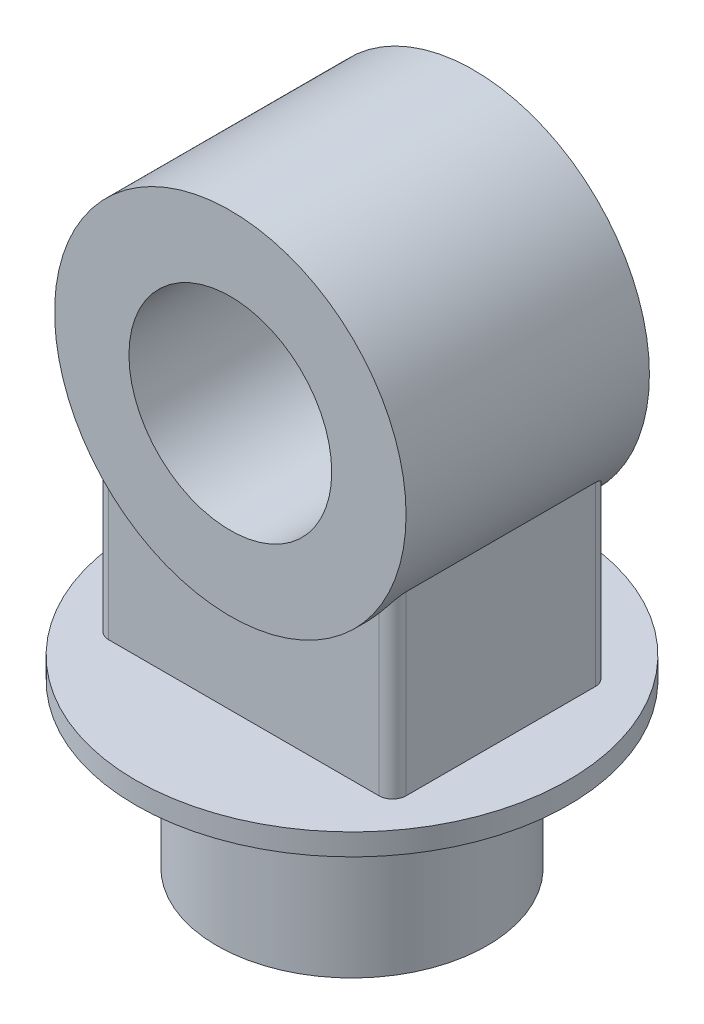
ISO-10303-21;
HEADER;
FILE_DESCRIPTION(('STEP AP214'),'2;1');
FILE_NAME('part.step','',(''),(''),'','','');
FILE_SCHEMA(('AUTOMOTIVE_DESIGN { 1 0 10303 214 1 1 1 1 }'));
ENDSEC;
DATA;
#1=APPLICATION_CONTEXT('core data for automotive mechanical design processes');
#2=APPLICATION_PROTOCOL_DEFINITION('international standard','automotive_design',2000,#1);
#3=PRODUCT_CONTEXT('',#1,'mechanical');
#4=PRODUCT('Part','Part','',(#3));
#5=PRODUCT_RELATED_PRODUCT_CATEGORY('part','',(#4));
#6=PRODUCT_DEFINITION_FORMATION('','',#4);
#7=PRODUCT_DEFINITION_CONTEXT('part definition',#1,'design');
#8=PRODUCT_DEFINITION('design','',#6,#7);
#9=PRODUCT_DEFINITION_SHAPE('','',#8);
#10=(LENGTH_UNIT() NAMED_UNIT(*) SI_UNIT(.MILLI.,.METRE.));
#11=(NAMED_UNIT(*) PLANE_ANGLE_UNIT() SI_UNIT($,.RADIAN.));
#12=(NAMED_UNIT(*) SI_UNIT($,.STERADIAN.) SOLID_ANGLE_UNIT());
#13=UNCERTAINTY_MEASURE_WITH_UNIT(LENGTH_MEASURE(1.E-05),#10,'distance_accuracy_value','');
#14=(GEOMETRIC_REPRESENTATION_CONTEXT(3) GLOBAL_UNCERTAINTY_ASSIGNED_CONTEXT((#13)) GLOBAL_UNIT_ASSIGNED_CONTEXT((#10,
#11,#12)) REPRESENTATION_CONTEXT('',''));
#15=CARTESIAN_POINT('',(0.,0.,0.));
#16=DIRECTION('',(0.,0.,1.));
#17=DIRECTION('',(1.,0.,0.));
#18=AXIS2_PLACEMENT_3D('',#15,#16,#17);
#19=CARTESIAN_POINT('',(0.,120.,0.));
#20=DIRECTION('',(0.,-1.,0.));
#21=DIRECTION('',(0.,0.,-1.));
#22=AXIS2_PLACEMENT_3D('',#19,#20,#21);
#23=CYLINDRICAL_SURFACE('',#22,100.);
#24=CARTESIAN_POINT('',(0.,120.,0.));
#25=DIRECTION('',(0.,1.,0.));
#26=DIRECTION('',(0.,0.,1.));
#27=AXIS2_PLACEMENT_3D('',#24,#25,#26);
#28=CIRCLE('',#27,100.);
#29=CARTESIAN_POINT('',(0.,120.,100.));
#30=VERTEX_POINT('',#29);
#31=EDGE_CURVE('E137',#30,#30,#28,.T.);
#32=ORIENTED_EDGE('',*,*,#31,.F.);
#33=EDGE_LOOP('',(#32));
#34=FACE_BOUND('',#33,.T.);
#35=CARTESIAN_POINT('',(0.,0.,0.));
#36=DIRECTION('',(0.,1.,0.));
#37=DIRECTION('',(0.,0.,1.));
#38=AXIS2_PLACEMENT_3D('',#35,#36,#37);
#39=CIRCLE('',#38,100.);
#40=CARTESIAN_POINT('',(0.,0.,100.));
#41=VERTEX_POINT('',#40);
#42=EDGE_CURVE('E211',#41,#41,#39,.T.);
#43=ORIENTED_EDGE('',*,*,#42,.T.);
#44=EDGE_LOOP('',(#43));
#45=FACE_BOUND('',#44,.T.);
#46=ADVANCED_FACE('F37',(#34,#45),#23,.T.);
#47=CARTESIAN_POINT('',(0.,0.,0.));
#48=DIRECTION('',(0.,1.,0.));
#49=DIRECTION('',(0.,0.,1.));
#50=AXIS2_PLACEMENT_3D('',#47,#48,#49);
#51=PLANE('',#50);
#52=ORIENTED_EDGE('',*,*,#42,.F.);
#53=EDGE_LOOP('',(#52));
#54=FACE_BOUND('',#53,.T.);
#55=ADVANCED_FACE('F220',(#54),#51,.F.);
#56=CARTESIAN_POINT('',(0.,136.,0.));
#57=DIRECTION('',(0.,-1.,0.));
#58=DIRECTION('',(0.,0.,-1.));
#59=AXIS2_PLACEMENT_3D('',#56,#57,#58);
#60=CYLINDRICAL_SURFACE('',#59,160.);
#61=CARTESIAN_POINT('',(0.,136.,0.));
#62=DIRECTION('',(0.,1.,0.));
#63=DIRECTION('',(0.,0.,1.));
#64=AXIS2_PLACEMENT_3D('',#61,#62,#63);
#65=CIRCLE('',#64,160.);
#66=CARTESIAN_POINT('',(0.,136.,160.));
#67=VERTEX_POINT('',#66);
#68=EDGE_CURVE('E208',#67,#67,#65,.T.);
#69=ORIENTED_EDGE('',*,*,#68,.F.);
#70=EDGE_LOOP('',(#69));
#71=FACE_BOUND('',#70,.T.);
#72=CARTESIAN_POINT('',(0.,120.,0.));
#73=DIRECTION('',(0.,1.,0.));
#74=DIRECTION('',(0.,0.,1.));
#75=AXIS2_PLACEMENT_3D('',#72,#73,#74);
#76=CIRCLE('',#75,160.);
#77=CARTESIAN_POINT('',(0.,120.,160.));
#78=VERTEX_POINT('',#77);
#79=EDGE_CURVE('E212',#78,#78,#76,.T.);
#80=ORIENTED_EDGE('',*,*,#79,.T.);
#81=EDGE_LOOP('',(#80));
#82=FACE_BOUND('',#81,.T.);
#83=ADVANCED_FACE('F222',(#71,#82),#60,.T.);
#84=CARTESIAN_POINT('',(0.,136.,0.));
#85=DIRECTION('',(0.,1.,0.));
#86=DIRECTION('',(0.,0.,1.));
#87=AXIS2_PLACEMENT_3D('',#84,#85,#86);
#88=PLANE('',#87);
#89=DIRECTION('',(0.,0.,-1.));
#90=VECTOR('',#89,1.);
#91=CARTESIAN_POINT('',(110.,136.,-80.));
#92=LINE('',#91,#90);
#93=CARTESIAN_POINT('',(110.,136.,70.));
#94=VERTEX_POINT('',#93);
#95=CARTESIAN_POINT('',(110.,136.,-70.));
#96=VERTEX_POINT('',#95);
#97=EDGE_CURVE('E188',#94,#96,#92,.T.);
#98=ORIENTED_EDGE('',*,*,#97,.F.);
#99=CARTESIAN_POINT('',(100.,136.,70.));
#100=DIRECTION('',(0.,1.,0.));
#101=DIRECTION('',(0.,0.,1.));
#102=AXIS2_PLACEMENT_3D('',#99,#100,#101);
#103=CIRCLE('',#102,10.);
#104=CARTESIAN_POINT('',(100.,136.,80.));
#105=VERTEX_POINT('',#104);
#106=EDGE_CURVE('E51',#94,#105,#103,.F.);
#107=ORIENTED_EDGE('',*,*,#106,.T.);
#108=DIRECTION('',(1.,0.,0.));
#109=VECTOR('',#108,1.);
#110=CARTESIAN_POINT('',(-110.,136.,80.));
#111=LINE('',#110,#109);
#112=CARTESIAN_POINT('',(-100.,136.,80.));
#113=VERTEX_POINT('',#112);
#114=EDGE_CURVE('E187',#113,#105,#111,.T.);
#115=ORIENTED_EDGE('',*,*,#114,.F.);
#116=CARTESIAN_POINT('',(-100.,136.,70.));
#117=DIRECTION('',(0.,1.,0.));
#118=DIRECTION('',(0.,0.,1.));
#119=AXIS2_PLACEMENT_3D('',#116,#117,#118);
#120=CIRCLE('',#119,10.);
#121=CARTESIAN_POINT('',(-110.,136.,70.));
#122=VERTEX_POINT('',#121);
#123=EDGE_CURVE('E120',#113,#122,#120,.F.);
#124=ORIENTED_EDGE('',*,*,#123,.T.);
#125=DIRECTION('',(0.,0.,1.));
#126=VECTOR('',#125,1.);
#127=CARTESIAN_POINT('',(-110.,136.,-80.));
#128=LINE('',#127,#126);
#129=CARTESIAN_POINT('',(-110.,136.,-70.));
#130=VERTEX_POINT('',#129);
#131=EDGE_CURVE('E189',#130,#122,#128,.T.);
#132=ORIENTED_EDGE('',*,*,#131,.F.);
#133=CARTESIAN_POINT('',(-100.,136.,-70.));
#134=DIRECTION('',(0.,1.,0.));
#135=DIRECTION('',(0.,0.,1.));
#136=AXIS2_PLACEMENT_3D('',#133,#134,#135);
#137=CIRCLE('',#136,10.);
#138=CARTESIAN_POINT('',(-100.,136.,-80.));
#139=VERTEX_POINT('',#138);
#140=EDGE_CURVE('E119',#130,#139,#137,.F.);
#141=ORIENTED_EDGE('',*,*,#140,.T.);
#142=DIRECTION('',(-1.,0.,0.));
#143=VECTOR('',#142,1.);
#144=CARTESIAN_POINT('',(-110.,136.,-80.));
#145=LINE('',#144,#143);
#146=CARTESIAN_POINT('',(100.,136.,-80.));
#147=VERTEX_POINT('',#146);
#148=EDGE_CURVE('E198',#147,#139,#145,.T.);
#149=ORIENTED_EDGE('',*,*,#148,.F.);
#150=CARTESIAN_POINT('',(100.,136.,-70.));
#151=DIRECTION('',(0.,1.,0.));
#152=DIRECTION('',(0.,0.,1.));
#153=AXIS2_PLACEMENT_3D('',#150,#151,#152);
#154=CIRCLE('',#153,10.);
#155=EDGE_CURVE('E58',#147,#96,#154,.F.);
#156=ORIENTED_EDGE('',*,*,#155,.T.);
#157=EDGE_LOOP('',(#98,#107,#115,#124,#132,#141,#149,#156));
#158=FACE_BOUND('',#157,.T.);
#159=ORIENTED_EDGE('',*,*,#68,.T.);
#160=EDGE_LOOP('',(#159));
#161=FACE_BOUND('',#160,.T.);
#162=ADVANCED_FACE('F185',(#158,#161),#88,.T.);
#163=CARTESIAN_POINT('',(0.,120.,0.));
#164=DIRECTION('',(0.,1.,0.));
#165=DIRECTION('',(0.,0.,1.));
#166=AXIS2_PLACEMENT_3D('',#163,#164,#165);
#167=PLANE('',#166);
#168=ORIENTED_EDGE('',*,*,#31,.T.);
#169=EDGE_LOOP('',(#168));
#170=FACE_BOUND('',#169,.T.);
#171=ORIENTED_EDGE('',*,*,#79,.F.);
#172=EDGE_LOOP('',(#171));
#173=FACE_BOUND('',#172,.T.);
#174=ADVANCED_FACE('F231',(#170,#173),#167,.F.);
#175=CARTESIAN_POINT('',(-110.,466.002,-80.));
#176=DIRECTION('',(0.,0.,1.));
#177=DIRECTION('',(1.,0.,0.));
#178=AXIS2_PLACEMENT_3D('',#175,#176,#177);
#179=PLANE('',#178);
#180=ORIENTED_EDGE('',*,*,#148,.T.);
#181=DIRECTION('',(0.,-1.,0.));
#182=VECTOR('',#181,1.);
#183=CARTESIAN_POINT('',(-100.,466.002,-80.));
#184=LINE('',#183,#182);
#185=CARTESIAN_POINT('',(-100.,252.933761370819,-80.));
#186=VERTEX_POINT('',#185);
#187=EDGE_CURVE('E145',#139,#186,#184,.F.);
#188=ORIENTED_EDGE('',*,*,#187,.T.);
#189=CARTESIAN_POINT('',(0.,336.,-80.));
#190=DIRECTION('',(0.,0.,1.));
#191=DIRECTION('',(1.,0.,0.));
#192=AXIS2_PLACEMENT_3D('',#189,#190,#191);
#193=CIRCLE('',#192,130.);
#194=CARTESIAN_POINT('',(100.,252.933761370819,-80.));
#195=VERTEX_POINT('',#194);
#196=EDGE_CURVE('E199',#195,#186,#193,.F.);
#197=ORIENTED_EDGE('',*,*,#196,.F.);
#198=DIRECTION('',(0.,-1.,0.));
#199=VECTOR('',#198,1.);
#200=CARTESIAN_POINT('',(100.,466.002,-80.));
#201=LINE('',#200,#199);
#202=EDGE_CURVE('E142',#195,#147,#201,.T.);
#203=ORIENTED_EDGE('',*,*,#202,.T.);
#204=EDGE_LOOP('',(#180,#188,#197,#203));
#205=FACE_BOUND('',#204,.T.);
#206=ADVANCED_FACE('F234',(#205),#179,.F.);
#207=CARTESIAN_POINT('',(110.,466.002,-80.));
#208=DIRECTION('',(-1.,0.,0.));
#209=DIRECTION('',(0.,0.,1.));
#210=AXIS2_PLACEMENT_3D('',#207,#208,#209);
#211=PLANE('',#210);
#212=ORIENTED_EDGE('',*,*,#97,.T.);
#213=DIRECTION('',(0.,-1.,0.));
#214=VECTOR('',#213,1.);
#215=CARTESIAN_POINT('',(110.,466.002,-70.));
#216=LINE('',#215,#214);
#217=CARTESIAN_POINT('',(110.,266.717967697245,-69.9999999999999));
#218=VERTEX_POINT('',#217);
#219=EDGE_CURVE('E149',#96,#218,#216,.F.);
#220=ORIENTED_EDGE('',*,*,#219,.T.);
#221=DIRECTION('',(0.,0.,-1.));
#222=VECTOR('',#221,1.);
#223=CARTESIAN_POINT('',(110.,266.717967697245,90.));
#224=LINE('',#223,#222);
#225=CARTESIAN_POINT('',(110.,266.717967697245,70.));
#226=VERTEX_POINT('',#225);
#227=EDGE_CURVE('E193',#226,#218,#224,.T.);
#228=ORIENTED_EDGE('',*,*,#227,.F.);
#229=DIRECTION('',(0.,-1.,0.));
#230=VECTOR('',#229,1.);
#231=CARTESIAN_POINT('',(110.,466.002,70.));
#232=LINE('',#231,#230);
#233=EDGE_CURVE('E147',#226,#94,#232,.T.);
#234=ORIENTED_EDGE('',*,*,#233,.T.);
#235=EDGE_LOOP('',(#212,#220,#228,#234));
#236=FACE_BOUND('',#235,.T.);
#237=ADVANCED_FACE('F196',(#236),#211,.F.);
#238=CARTESIAN_POINT('',(-110.,466.002,-80.));
#239=DIRECTION('',(1.,0.,0.));
#240=DIRECTION('',(0.,0.,-1.));
#241=AXIS2_PLACEMENT_3D('',#238,#239,#240);
#242=PLANE('',#241);
#243=ORIENTED_EDGE('',*,*,#131,.T.);
#244=DIRECTION('',(0.,-1.,0.));
#245=VECTOR('',#244,1.);
#246=CARTESIAN_POINT('',(-110.,466.002,70.));
#247=LINE('',#246,#245);
#248=CARTESIAN_POINT('',(-110.,266.717967697245,70.));
#249=VERTEX_POINT('',#248);
#250=EDGE_CURVE('E135',#122,#249,#247,.F.);
#251=ORIENTED_EDGE('',*,*,#250,.T.);
#252=DIRECTION('',(0.,0.,-1.));
#253=VECTOR('',#252,1.);
#254=CARTESIAN_POINT('',(-110.,266.717967697245,90.));
#255=LINE('',#254,#253);
#256=CARTESIAN_POINT('',(-110.,266.717967697245,-70.));
#257=VERTEX_POINT('',#256);
#258=EDGE_CURVE('E115',#257,#249,#255,.F.);
#259=ORIENTED_EDGE('',*,*,#258,.F.);
#260=DIRECTION('',(0.,-1.,0.));
#261=VECTOR('',#260,1.);
#262=CARTESIAN_POINT('',(-110.,466.002,-70.));
#263=LINE('',#262,#261);
#264=EDGE_CURVE('E132',#257,#130,#263,.T.);
#265=ORIENTED_EDGE('',*,*,#264,.T.);
#266=EDGE_LOOP('',(#243,#251,#259,#265));
#267=FACE_BOUND('',#266,.T.);
#268=ADVANCED_FACE('F240',(#267),#242,.F.);
#269=CARTESIAN_POINT('',(-110.,466.002,80.));
#270=DIRECTION('',(0.,0.,-1.));
#271=DIRECTION('',(-1.,0.,0.));
#272=AXIS2_PLACEMENT_3D('',#269,#270,#271);
#273=PLANE('',#272);
#274=CARTESIAN_POINT('',(0.,336.,80.));
#275=DIRECTION('',(0.,0.,-1.));
#276=DIRECTION('',(-1.,0.,0.));
#277=AXIS2_PLACEMENT_3D('',#274,#275,#276);
#278=CIRCLE('',#277,130.);
#279=CARTESIAN_POINT('',(-100.,252.933761370819,80.));
#280=VERTEX_POINT('',#279);
#281=CARTESIAN_POINT('',(100.,252.933761370819,80.));
#282=VERTEX_POINT('',#281);
#283=EDGE_CURVE('E112',#280,#282,#278,.F.);
#284=ORIENTED_EDGE('',*,*,#283,.F.);
#285=DIRECTION('',(0.,-1.,0.));
#286=VECTOR('',#285,1.);
#287=CARTESIAN_POINT('',(-100.,466.002,80.));
#288=LINE('',#287,#286);
#289=EDGE_CURVE('E126',#280,#113,#288,.T.);
#290=ORIENTED_EDGE('',*,*,#289,.T.);
#291=ORIENTED_EDGE('',*,*,#114,.T.);
#292=DIRECTION('',(0.,-1.,0.));
#293=VECTOR('',#292,1.);
#294=CARTESIAN_POINT('',(100.,466.002,80.));
#295=LINE('',#294,#293);
#296=EDGE_CURVE('E128',#105,#282,#295,.F.);
#297=ORIENTED_EDGE('',*,*,#296,.T.);
#298=EDGE_LOOP('',(#284,#290,#291,#297));
#299=FACE_BOUND('',#298,.T.);
#300=ADVANCED_FACE('F124',(#299),#273,.F.);
#301=CARTESIAN_POINT('',(0.,336.,90.));
#302=DIRECTION('',(0.,0.,-1.));
#303=DIRECTION('',(-1.,0.,0.));
#304=AXIS2_PLACEMENT_3D('',#301,#302,#303);
#305=CYLINDRICAL_SURFACE('',#304,130.);
#306=CARTESIAN_POINT('',(0.,336.,90.));
#307=DIRECTION('',(0.,0.,1.));
#308=DIRECTION('',(1.,0.,0.));
#309=AXIS2_PLACEMENT_3D('',#306,#307,#308);
#310=CIRCLE('',#309,130.);
#311=CARTESIAN_POINT('',(130.,336.,90.));
#312=VERTEX_POINT('',#311);
#313=EDGE_CURVE('E129',#312,#312,#310,.T.);
#314=ORIENTED_EDGE('',*,*,#313,.F.);
#315=EDGE_LOOP('',(#314));
#316=FACE_BOUND('',#315,.T.);
#317=CARTESIAN_POINT('',(0.,336.,-90.));
#318=DIRECTION('',(0.,0.,1.));
#319=DIRECTION('',(1.,0.,0.));
#320=AXIS2_PLACEMENT_3D('',#317,#318,#319);
#321=CIRCLE('',#320,130.);
#322=CARTESIAN_POINT('',(130.,336.,-90.));
#323=VERTEX_POINT('',#322);
#324=EDGE_CURVE('E258',#323,#323,#321,.T.);
#325=ORIENTED_EDGE('',*,*,#324,.T.);
#326=EDGE_LOOP('',(#325));
#327=FACE_BOUND('',#326,.T.);
#328=ORIENTED_EDGE('',*,*,#283,.T.);
#329=CARTESIAN_POINT('',(100.,252.933761370819,80.));
#330=CARTESIAN_POINT('',(100.223611151915,253.202952503255,79.9999830665315));
#331=CARTESIAN_POINT('',(100.446118360057,253.473036166024,79.9924995885085));
#332=CARTESIAN_POINT('',(100.888548742496,254.014496760122,79.9629173131463));
#333=CARTESIAN_POINT('',(101.108472043759,254.285873626978,79.9408192370116));
#334=CARTESIAN_POINT('',(101.545586290072,254.829711400373,79.8822979337703));
#335=CARTESIAN_POINT('',(101.76277446753,255.102173087004,79.8458612385231));
#336=CARTESIAN_POINT('',(102.193849033468,255.647413797012,79.7588609087488));
#337=CARTESIAN_POINT('',(102.407735374993,255.920192824843,79.7082970735217));
#338=CARTESIAN_POINT('',(103.048408055095,256.74400885936,79.5343891784366));
#339=CARTESIAN_POINT('',(103.469748368072,257.294974230618,79.3894263280958));
#340=CARTESIAN_POINT('',(104.088382224678,258.117224843771,79.1288060997197));
#341=CARTESIAN_POINT('',(104.292337034927,258.39057162742,79.0347525474725));
#342=CARTESIAN_POINT('',(104.695498702643,258.935304765081,78.8319429710982));
#343=CARTESIAN_POINT('',(104.894706004332,259.206691300842,78.7231883289499));
#344=CARTESIAN_POINT('',(105.336170271764,259.812965668139,78.4620472638272));
#345=CARTESIAN_POINT('',(105.577006541077,260.147108038148,78.3055009036513));
#346=CARTESIAN_POINT('',(106.04966094987,260.809343252621,77.967808626391));
#347=CARTESIAN_POINT('',(106.281479043935,261.137436066616,77.7866625854444));
#348=CARTESIAN_POINT('',(106.734152264033,261.784259610706,77.3986376161628));
#349=CARTESIAN_POINT('',(106.955036134368,262.103013877598,77.1918317878757));
#350=CARTESIAN_POINT('',(107.384708325122,262.728803605627,76.749894392022));
#351=CARTESIAN_POINT('',(107.593501627276,263.035843875289,76.5147746155493));
#352=CARTESIAN_POINT('',(107.921279015409,263.522080966666,76.1068757916446));
#353=CARTESIAN_POINT('',(108.044709884718,263.706240813682,75.9435605188263));
#354=CARTESIAN_POINT('',(108.284949666933,264.066582834907,75.6038296157539));
#355=CARTESIAN_POINT('',(108.401760304956,264.242767084986,75.4274174262629));
#356=CARTESIAN_POINT('',(108.627683741988,264.585236991633,75.0605773993747));
#357=CARTESIAN_POINT('',(108.736797961361,264.751524473746,74.8701521613913));
#358=CARTESIAN_POINT('',(108.945874410432,265.071634412635,74.4745306992528));
#359=CARTESIAN_POINT('',(109.04583974995,265.225461102935,74.2693395369045));
#360=CARTESIAN_POINT('',(109.274660386151,265.579056080623,73.7536743100227));
#361=CARTESIAN_POINT('',(109.398046362816,265.771031349643,73.4351396850742));
#362=CARTESIAN_POINT('',(109.561336457207,266.026263049992,72.9345418523036));
#363=CARTESIAN_POINT('',(109.612072269395,266.105785634321,72.7641622498837));
#364=CARTESIAN_POINT('',(109.705421847597,266.25239837099,72.4160328323223));
#365=CARTESIAN_POINT('',(109.748040656091,266.319496241142,72.2382876769633));
#366=CARTESIAN_POINT('',(109.820262744001,266.433384610412,71.8947331689277));
#367=CARTESIAN_POINT('',(109.850752312767,266.481551609067,71.7295676109391));
#368=CARTESIAN_POINT('',(109.903691363628,266.565274678988,71.3948451418077));
#369=CARTESIAN_POINT('',(109.926143541964,266.600834979285,71.2252897238034));
#370=CARTESIAN_POINT('',(109.962659042777,266.658707696818,70.8807814271978));
#371=CARTESIAN_POINT('',(109.976613864032,266.680848750137,70.7057875562757));
#372=CARTESIAN_POINT('',(109.99061964662,266.703076138542,70.4419386674803));
#373=CARTESIAN_POINT('',(109.99413386492,266.708654625171,70.3536902139711));
#374=CARTESIAN_POINT('',(109.998824989492,266.716102079046,70.1769662160103));
#375=CARTESIAN_POINT('',(110.000001659485,266.717970671296,70.088490649507));
#376=CARTESIAN_POINT('',(110.,266.717967697245,70.));
#377=B_SPLINE_CURVE_WITH_KNOTS('',3,(#329,#330,#331,#332,#333,#334,#335,#336,#337,#338,#339,
#340,#341,#342,#343,#344,#345,#346,#347,#348,#349,#350,#351,#352,#353,#354,#355,#356,#357,#358,
#359,#360,#361,#362,#363,#364,#365,#366,#367,#368,#369,#370,#371,#372,#373,#374,#375,#376),
.UNSPECIFIED.,.F.,.F.,(4,2,2,2,2,2,2,2,2,2,2,2,2,2,2,2,2,2,2,2,2,2,2,4),(0.,1.04974156507782,
2.09943133114573,3.15010942417265,4.20080244462031,6.32356278933861,7.38465211465334,
8.44564176134499,9.76677685539395,11.087918601761,12.4053795382948,13.7222937149077,
14.5479419827463,15.3733741023698,16.1986534888325,17.023651302289,18.1946866504919,
18.7783719827905,19.3616935243415,19.8852298594992,20.408590403038,20.9385006934629,
21.2038887699912,21.4693036704869),.UNSPECIFIED.);
#378=EDGE_CURVE('E11',#282,#226,#377,.T.);
#379=ORIENTED_EDGE('',*,*,#378,.T.);
#380=ORIENTED_EDGE('',*,*,#227,.T.);
#381=CARTESIAN_POINT('',(110.,266.717967697245,-70.));
#382=CARTESIAN_POINT('',(110.000033683462,266.718025852698,-70.1614230595313));
#383=CARTESIAN_POINT('',(109.996092792414,266.711764254296,-70.3228118197691));
#384=CARTESIAN_POINT('',(109.980519982779,266.687045880384,-70.6441123999957));
#385=CARTESIAN_POINT('',(109.968896213713,266.668602027069,-70.8040256031146));
#386=CARTESIAN_POINT('',(109.938376398954,266.620217986395,-71.1196424551221));
#387=CARTESIAN_POINT('',(109.919558261622,266.590400967593,-71.2753727040436));
#388=CARTESIAN_POINT('',(109.875071558334,266.52000006118,-71.5834085562726));
#389=CARTESIAN_POINT('',(109.849400846184,266.479412800404,-71.7357130704249));
#390=CARTESIAN_POINT('',(109.784772267017,266.377386983169,-72.0722520040974));
#391=CARTESIAN_POINT('',(109.744103525393,266.313281105856,-72.2553511890568));
#392=CARTESIAN_POINT('',(109.654040532803,266.17165023193,-72.6141464391851));
#393=CARTESIAN_POINT('',(109.604640075501,266.094115691273,-72.7898371277865));
#394=CARTESIAN_POINT('',(109.497968805892,265.927147418338,-73.133872391345));
#395=CARTESIAN_POINT('',(109.440667457039,265.837667562915,-73.302184951541));
#396=CARTESIAN_POINT('',(109.319341126161,265.648779195145,-73.6304969218558));
#397=CARTESIAN_POINT('',(109.25531768694,265.549372961282,-73.7904982269664));
#398=CARTESIAN_POINT('',(109.085069343255,265.28590129292,-74.1868876463209));
#399=CARTESIAN_POINT('',(108.974781990569,265.115997241409,-74.4176642111939));
#400=CARTESIAN_POINT('',(108.742772943656,264.76058359918,-74.8607110351426));
#401=CARTESIAN_POINT('',(108.621044869784,264.575065307649,-75.072970840064));
#402=CARTESIAN_POINT('',(108.36794946479,264.19164129378,-75.4804206329535));
#403=CARTESIAN_POINT('',(108.236568322626,263.993717884812,-75.6755852518652));
#404=CARTESIAN_POINT('',(107.965814499919,263.588382733387,-76.0497203250662));
#405=CARTESIAN_POINT('',(107.826442440892,263.380971729107,-76.2286920360201));
#406=CARTESIAN_POINT('',(107.56145650763,262.989174407744,-76.5468161797372));
#407=CARTESIAN_POINT('',(107.436764821801,262.805791987749,-76.6879854690674));
#408=CARTESIAN_POINT('',(107.182869679799,262.434497987953,-76.9599552926783));
#409=CARTESIAN_POINT('',(107.053665586411,262.24658576965,-77.0907543539386));
#410=CARTESIAN_POINT('',(106.659844344167,261.677121003612,-77.4685356621902));
#411=CARTESIAN_POINT('',(106.389102445143,261.289965080353,-77.7008024816961));
#412=CARTESIAN_POINT('',(105.833418194947,260.504836154638,-78.129863631631));
#413=CARTESIAN_POINT('',(105.548442441802,260.106838810795,-78.3265689888296));
#414=CARTESIAN_POINT('',(104.96676628824,259.304344779382,-78.6860846955171));
#415=CARTESIAN_POINT('',(104.670068038633,258.899849292081,-78.8489012287858));
#416=CARTESIAN_POINT('',(104.024574509401,258.030646711215,-79.1623550419402));
#417=CARTESIAN_POINT('',(103.674248758637,257.565348460988,-79.3081944572228));
#418=CARTESIAN_POINT('',(102.961876677953,256.632523338709,-79.558756520093));
#419=CARTESIAN_POINT('',(102.599828734006,256.16499616738,-79.6634734792563));
#420=CARTESIAN_POINT('',(102.051092736822,255.466397204689,-79.7891645729388));
#421=CARTESIAN_POINT('',(101.868137468165,255.235094848973,-79.8257282191264));
#422=CARTESIAN_POINT('',(101.499966150616,254.77288550036,-79.8886289353229));
#423=CARTESIAN_POINT('',(101.314750133026,254.541978502041,-79.9149661467555));
#424=CARTESIAN_POINT('',(100.942320486513,254.080919722901,-79.9572665465168));
#425=CARTESIAN_POINT('',(100.755107350153,253.850767773367,-79.9732322353467));
#426=CARTESIAN_POINT('',(100.378860262163,253.391449185777,-79.9945948234744));
#427=CARTESIAN_POINT('',(100.189826234412,253.162282589497,-79.9999912789888));
#428=CARTESIAN_POINT('',(100.,252.933761370819,-80.));
#429=B_SPLINE_CURVE_WITH_KNOTS('',3,(#381,#382,#383,#384,#385,#386,#387,#388,#389,#390,#391,
#392,#393,#394,#395,#396,#397,#398,#399,#400,#401,#402,#403,#404,#405,#406,#407,#408,#409,#410,
#411,#412,#413,#414,#415,#416,#417,#418,#419,#420,#421,#422,#423,#424,#425,#426,#427,#428),
.UNSPECIFIED.,.F.,.F.,(4,2,2,2,2,2,2,2,2,2,2,2,2,2,2,2,2,2,2,2,2,2,2,4),(0.,0.484045005923069,
0.967577389145413,1.44601544684509,1.92460352520314,2.51835043890467,3.11252108624072,
3.7090561398874,4.30545457926273,5.22516595363376,6.14539326092329,7.06696382284195,
7.98846280401965,8.77680092000541,9.56525081419904,11.1426900482287,12.7240229357798,
14.305067020047,16.1047501551828,17.9046821508917,18.7960435003637,19.6873925225409,
20.5785265668948,21.4696980275819),.UNSPECIFIED.);
#430=EDGE_CURVE('E180',#218,#195,#429,.T.);
#431=ORIENTED_EDGE('',*,*,#430,.T.);
#432=ORIENTED_EDGE('',*,*,#196,.T.);
#433=CARTESIAN_POINT('',(-100.,252.933761370819,-80.));
#434=CARTESIAN_POINT('',(-100.223611151915,253.202952503255,-79.9999830665315));
#435=CARTESIAN_POINT('',(-100.446118360057,253.473036166024,-79.9924995885085));
#436=CARTESIAN_POINT('',(-100.888548742496,254.014496760122,-79.9629173131463));
#437=CARTESIAN_POINT('',(-101.108472043759,254.285873626978,-79.9408192370116));
#438=CARTESIAN_POINT('',(-101.545586290072,254.829711400373,-79.8822979337703));
#439=CARTESIAN_POINT('',(-101.76277446753,255.102173087004,-79.8458612385231));
#440=CARTESIAN_POINT('',(-102.193849033468,255.647413797012,-79.7588609087488));
#441=CARTESIAN_POINT('',(-102.407735374993,255.920192824843,-79.7082970735217));
#442=CARTESIAN_POINT('',(-103.048408055095,256.74400885936,-79.5343891784366));
#443=CARTESIAN_POINT('',(-103.469748368072,257.294974230618,-79.3894263280958));
#444=CARTESIAN_POINT('',(-104.088382224678,258.117224843771,-79.1288060997197));
#445=CARTESIAN_POINT('',(-104.292337034927,258.39057162742,-79.0347525474724));
#446=CARTESIAN_POINT('',(-104.695498702643,258.935304765081,-78.8319429710982));
#447=CARTESIAN_POINT('',(-104.894706004332,259.206691300842,-78.7231883289499));
#448=CARTESIAN_POINT('',(-105.336170271764,259.812965668139,-78.4620472638272));
#449=CARTESIAN_POINT('',(-105.577006541077,260.147108038148,-78.3055009036513));
#450=CARTESIAN_POINT('',(-106.04966094987,260.809343252621,-77.967808626391));
#451=CARTESIAN_POINT('',(-106.281479043935,261.137436066616,-77.7866625854444));
#452=CARTESIAN_POINT('',(-106.734152264033,261.784259610706,-77.3986376161628));
#453=CARTESIAN_POINT('',(-106.955036134368,262.103013877599,-77.1918317878758));
#454=CARTESIAN_POINT('',(-107.384708325122,262.728803605627,-76.749894392022));
#455=CARTESIAN_POINT('',(-107.593501627276,263.035843875289,-76.5147746155492));
#456=CARTESIAN_POINT('',(-107.921279015409,263.522080966666,-76.1068757916446));
#457=CARTESIAN_POINT('',(-108.044709884718,263.706240813682,-75.9435605188263));
#458=CARTESIAN_POINT('',(-108.284949666933,264.066582834907,-75.6038296157538));
#459=CARTESIAN_POINT('',(-108.401760304956,264.242767084986,-75.4274174262629));
#460=CARTESIAN_POINT('',(-108.627683741988,264.585236991633,-75.0605773993747));
#461=CARTESIAN_POINT('',(-108.736797961361,264.751524473746,-74.8701521613913));
#462=CARTESIAN_POINT('',(-108.945874410432,265.071634412635,-74.4745306992528));
#463=CARTESIAN_POINT('',(-109.04583974995,265.225461102935,-74.2693395369045));
#464=CARTESIAN_POINT('',(-109.274660386151,265.579056080623,-73.7536743100228));
#465=CARTESIAN_POINT('',(-109.398046362816,265.771031349643,-73.4351396850743));
#466=CARTESIAN_POINT('',(-109.561336457207,266.026263049992,-72.9345418523036));
#467=CARTESIAN_POINT('',(-109.612072269395,266.105785634321,-72.7641622498837));
#468=CARTESIAN_POINT('',(-109.705421847597,266.25239837099,-72.4160328323223));
#469=CARTESIAN_POINT('',(-109.748040656091,266.319496241142,-72.2382876769633));
#470=CARTESIAN_POINT('',(-109.820262744001,266.433384610412,-71.8947331689277));
#471=CARTESIAN_POINT('',(-109.850752312767,266.481551609067,-71.7295676109391));
#472=CARTESIAN_POINT('',(-109.903691363628,266.565274678988,-71.3948451418077));
#473=CARTESIAN_POINT('',(-109.926143541964,266.600834979285,-71.2252897238034));
#474=CARTESIAN_POINT('',(-109.962659042777,266.658707696818,-70.8807814271978));
#475=CARTESIAN_POINT('',(-109.976613864032,266.680848750137,-70.7057875562757));
#476=CARTESIAN_POINT('',(-109.99061964662,266.703076138542,-70.4419386674803));
#477=CARTESIAN_POINT('',(-109.99413386492,266.708654625171,-70.3536902139711));
#478=CARTESIAN_POINT('',(-109.998824989492,266.716102079046,-70.1769662160102));
#479=CARTESIAN_POINT('',(-110.000001659485,266.717970671296,-70.088490649507));
#480=CARTESIAN_POINT('',(-110.,266.717967697245,-70.));
#481=B_SPLINE_CURVE_WITH_KNOTS('',3,(#433,#434,#435,#436,#437,#438,#439,#440,#441,#442,#443,
#444,#445,#446,#447,#448,#449,#450,#451,#452,#453,#454,#455,#456,#457,#458,#459,#460,#461,#462,
#463,#464,#465,#466,#467,#468,#469,#470,#471,#472,#473,#474,#475,#476,#477,#478,#479,#480),
.UNSPECIFIED.,.F.,.F.,(4,2,2,2,2,2,2,2,2,2,2,2,2,2,2,2,2,2,2,2,2,2,2,4),(0.,1.04974156507777,
2.09943133114568,3.1501094241726,4.20080244462026,6.32356278933854,7.38465211465329,
8.44564176134495,9.7667768553939,11.0879186017609,12.4053795382948,13.7222937149076,
14.5479419827463,15.3733741023697,16.1986534888326,17.0236513022889,18.1946866504919,
18.7783719827905,19.3616935243414,19.8852298594992,20.408590403038,20.9385006934629,
21.2038887699912,21.4693036704869),.UNSPECIFIED.);
#482=EDGE_CURVE('E173',#186,#257,#481,.T.);
#483=ORIENTED_EDGE('',*,*,#482,.T.);
#484=ORIENTED_EDGE('',*,*,#258,.T.);
#485=CARTESIAN_POINT('',(-110.,266.717967697245,70.));
#486=CARTESIAN_POINT('',(-110.000033683462,266.718025852698,70.1614230595313));
#487=CARTESIAN_POINT('',(-109.996092792414,266.711764254296,70.3228118197691));
#488=CARTESIAN_POINT('',(-109.980519982779,266.687045880384,70.6441123999957));
#489=CARTESIAN_POINT('',(-109.968896213713,266.668602027069,70.8040256031146));
#490=CARTESIAN_POINT('',(-109.938376398954,266.620217986395,71.1196424551221));
#491=CARTESIAN_POINT('',(-109.919558261622,266.590400967593,71.2753727040436));
#492=CARTESIAN_POINT('',(-109.875071558334,266.52000006118,71.5834085562726));
#493=CARTESIAN_POINT('',(-109.849400846184,266.479412800404,71.7357130704249));
#494=CARTESIAN_POINT('',(-109.784772267017,266.377386983169,72.0722520040974));
#495=CARTESIAN_POINT('',(-109.744103525393,266.313281105856,72.2553511890568));
#496=CARTESIAN_POINT('',(-109.654040532803,266.17165023193,72.6141464391851));
#497=CARTESIAN_POINT('',(-109.604640075501,266.094115691273,72.7898371277865));
#498=CARTESIAN_POINT('',(-109.497968805892,265.927147418338,73.133872391345));
#499=CARTESIAN_POINT('',(-109.440667457039,265.837667562915,73.302184951541));
#500=CARTESIAN_POINT('',(-109.319341126161,265.648779195145,73.6304969218558));
#501=CARTESIAN_POINT('',(-109.25531768694,265.549372961282,73.7904982269664));
#502=CARTESIAN_POINT('',(-109.085069343255,265.28590129292,74.1868876463209));
#503=CARTESIAN_POINT('',(-108.974781990569,265.115997241409,74.4176642111939));
#504=CARTESIAN_POINT('',(-108.742772943656,264.76058359918,74.8607110351426));
#505=CARTESIAN_POINT('',(-108.621044869784,264.575065307649,75.072970840064));
#506=CARTESIAN_POINT('',(-108.36794946479,264.19164129378,75.4804206329535));
#507=CARTESIAN_POINT('',(-108.236568322626,263.993717884812,75.6755852518652));
#508=CARTESIAN_POINT('',(-107.965814499919,263.588382733387,76.0497203250662));
#509=CARTESIAN_POINT('',(-107.826442440892,263.380971729107,76.2286920360201));
#510=CARTESIAN_POINT('',(-107.56145650763,262.989174407744,76.5468161797372));
#511=CARTESIAN_POINT('',(-107.436764821801,262.805791987749,76.6879854690674));
#512=CARTESIAN_POINT('',(-107.182869679799,262.434497987953,76.9599552926783));
#513=CARTESIAN_POINT('',(-107.053665586411,262.24658576965,77.0907543539386));
#514=CARTESIAN_POINT('',(-106.659844344167,261.677121003612,77.4685356621902));
#515=CARTESIAN_POINT('',(-106.389102445143,261.289965080353,77.7008024816961));
#516=CARTESIAN_POINT('',(-105.833418194947,260.504836154638,78.129863631631));
#517=CARTESIAN_POINT('',(-105.548442441802,260.106838810795,78.3265689888296));
#518=CARTESIAN_POINT('',(-104.96676628824,259.304344779382,78.6860846955171));
#519=CARTESIAN_POINT('',(-104.670068038633,258.899849292081,78.8489012287858));
#520=CARTESIAN_POINT('',(-104.024574509401,258.030646711215,79.1623550419402));
#521=CARTESIAN_POINT('',(-103.674248758637,257.565348460988,79.3081944572228));
#522=CARTESIAN_POINT('',(-102.961876677953,256.632523338709,79.558756520093));
#523=CARTESIAN_POINT('',(-102.599828734006,256.16499616738,79.6634734792563));
#524=CARTESIAN_POINT('',(-102.051092736822,255.466397204689,79.7891645729387));
#525=CARTESIAN_POINT('',(-101.868137468165,255.235094848973,79.8257282191264));
#526=CARTESIAN_POINT('',(-101.499966150616,254.77288550036,79.8886289353229));
#527=CARTESIAN_POINT('',(-101.314750133026,254.541978502041,79.9149661467555));
#528=CARTESIAN_POINT('',(-100.942320486513,254.080919722901,79.9572665465168));
#529=CARTESIAN_POINT('',(-100.755107350153,253.850767773367,79.9732322353467));
#530=CARTESIAN_POINT('',(-100.378860262163,253.391449185777,79.9945948234744));
#531=CARTESIAN_POINT('',(-100.189826234412,253.162282589497,79.9999912789888));
#532=CARTESIAN_POINT('',(-100.,252.933761370819,80.));
#533=B_SPLINE_CURVE_WITH_KNOTS('',3,(#485,#486,#487,#488,#489,#490,#491,#492,#493,#494,#495,
#496,#497,#498,#499,#500,#501,#502,#503,#504,#505,#506,#507,#508,#509,#510,#511,#512,#513,#514,
#515,#516,#517,#518,#519,#520,#521,#522,#523,#524,#525,#526,#527,#528,#529,#530,#531,#532),
.UNSPECIFIED.,.F.,.F.,(4,2,2,2,2,2,2,2,2,2,2,2,2,2,2,2,2,2,2,2,2,2,2,4),(0.,0.48404500592307,
0.967577389145426,1.44601544684507,1.92460352520314,2.51835043890468,3.11252108624077,
3.70905613988741,4.30545457926274,5.22516595363375,6.1453932609233,7.06696382284192,
7.98846280401964,8.77680092000536,9.56525081419896,11.1426900482287,12.7240229357798,
14.305067020047,16.1047501551828,17.9046821508917,18.7960435003637,19.6873925225409,
20.5785265668947,21.4696980275819),.UNSPECIFIED.);
#534=EDGE_CURVE('E109',#249,#280,#533,.T.);
#535=ORIENTED_EDGE('',*,*,#534,.T.);
#536=EDGE_LOOP('',(#328,#379,#380,#431,#432,#483,#484,#535));
#537=FACE_BOUND('',#536,.T.);
#538=ADVANCED_FACE('F111',(#316,#327,#537),#305,.T.);
#539=CARTESIAN_POINT('',(0.,336.,90.));
#540=DIRECTION('',(0.,0.,1.));
#541=DIRECTION('',(1.,0.,0.));
#542=AXIS2_PLACEMENT_3D('',#539,#540,#541);
#543=PLANE('',#542);
#544=ORIENTED_EDGE('',*,*,#313,.T.);
#545=EDGE_LOOP('',(#544));
#546=FACE_BOUND('',#545,.T.);
#547=CARTESIAN_POINT('',(0.,336.,90.));
#548=DIRECTION('',(0.,0.,1.));
#549=DIRECTION('',(1.,0.,0.));
#550=AXIS2_PLACEMENT_3D('',#547,#548,#549);
#551=CIRCLE('',#550,75.);
#552=CARTESIAN_POINT('',(-75.,336.,90.));
#553=VERTEX_POINT('',#552);
#554=EDGE_CURVE('E261',#553,#553,#551,.T.);
#555=ORIENTED_EDGE('',*,*,#554,.F.);
#556=EDGE_LOOP('',(#555));
#557=FACE_BOUND('',#556,.T.);
#558=ADVANCED_FACE('F272',(#546,#557),#543,.T.);
#559=CARTESIAN_POINT('',(0.,336.,-90.));
#560=DIRECTION('',(0.,0.,1.));
#561=DIRECTION('',(1.,0.,0.));
#562=AXIS2_PLACEMENT_3D('',#559,#560,#561);
#563=PLANE('',#562);
#564=ORIENTED_EDGE('',*,*,#324,.F.);
#565=EDGE_LOOP('',(#564));
#566=FACE_BOUND('',#565,.T.);
#567=CARTESIAN_POINT('',(0.,336.,-90.));
#568=DIRECTION('',(0.,0.,1.));
#569=DIRECTION('',(1.,0.,0.));
#570=AXIS2_PLACEMENT_3D('',#567,#568,#569);
#571=CIRCLE('',#570,75.);
#572=CARTESIAN_POINT('',(-75.,336.,-90.));
#573=VERTEX_POINT('',#572);
#574=EDGE_CURVE('E264',#573,#573,#571,.T.);
#575=ORIENTED_EDGE('',*,*,#574,.T.);
#576=EDGE_LOOP('',(#575));
#577=FACE_BOUND('',#576,.T.);
#578=ADVANCED_FACE('F274',(#566,#577),#563,.F.);
#579=CARTESIAN_POINT('',(0.,336.,90.));
#580=DIRECTION('',(0.,0.,-1.));
#581=DIRECTION('',(-1.,0.,0.));
#582=AXIS2_PLACEMENT_3D('',#579,#580,#581);
#583=CYLINDRICAL_SURFACE('',#582,75.);
#584=CARTESIAN_POINT('',(-75.,336.,90.));
#585=CARTESIAN_POINT('',(-75.,336.,88.125));
#586=CARTESIAN_POINT('',(-75.,336.,86.25));
#587=CARTESIAN_POINT('',(-75.,336.,82.5));
#588=CARTESIAN_POINT('',(-75.,336.,80.625));
#589=CARTESIAN_POINT('',(-75.,336.,76.875));
#590=CARTESIAN_POINT('',(-75.,336.,75.));
#591=CARTESIAN_POINT('',(-75.,336.,71.25));
#592=CARTESIAN_POINT('',(-75.,336.,69.375));
#593=CARTESIAN_POINT('',(-75.,336.,65.625));
#594=CARTESIAN_POINT('',(-75.,336.,63.75));
#595=CARTESIAN_POINT('',(-75.,336.,60.));
#596=CARTESIAN_POINT('',(-75.,336.,58.125));
#597=CARTESIAN_POINT('',(-75.,336.,54.375));
#598=CARTESIAN_POINT('',(-75.,336.,52.5));
#599=CARTESIAN_POINT('',(-75.,336.,48.75));
#600=CARTESIAN_POINT('',(-75.,336.,46.875));
#601=CARTESIAN_POINT('',(-75.,336.,43.125));
#602=CARTESIAN_POINT('',(-75.,336.,41.25));
#603=CARTESIAN_POINT('',(-75.,336.,37.5));
#604=CARTESIAN_POINT('',(-75.,336.,35.625));
#605=CARTESIAN_POINT('',(-75.,336.,31.875));
#606=CARTESIAN_POINT('',(-75.,336.,30.));
#607=CARTESIAN_POINT('',(-75.,336.,26.25));
#608=CARTESIAN_POINT('',(-75.,336.,24.375));
#609=CARTESIAN_POINT('',(-75.,336.,20.625));
#610=CARTESIAN_POINT('',(-75.,336.,18.75));
#611=CARTESIAN_POINT('',(-75.,336.,15.));
#612=CARTESIAN_POINT('',(-75.,336.,13.125));
#613=CARTESIAN_POINT('',(-75.,336.,9.37499999999998));
#614=CARTESIAN_POINT('',(-75.,336.,7.49999999999998));
#615=CARTESIAN_POINT('',(-75.,336.,3.74999999999998));
#616=CARTESIAN_POINT('',(-75.,336.,1.87499999999997));
#617=CARTESIAN_POINT('',(-75.,336.,-1.87500000000003));
#618=CARTESIAN_POINT('',(-75.,336.,-3.75000000000003));
#619=CARTESIAN_POINT('',(-75.,336.,-7.50000000000003));
#620=CARTESIAN_POINT('',(-75.,336.,-9.37500000000004));
#621=CARTESIAN_POINT('',(-75.,336.,-13.125));
#622=CARTESIAN_POINT('',(-75.,336.,-15.));
#623=CARTESIAN_POINT('',(-75.,336.,-18.75));
#624=CARTESIAN_POINT('',(-75.,336.,-20.625));
#625=CARTESIAN_POINT('',(-75.,336.,-24.375));
#626=CARTESIAN_POINT('',(-75.,336.,-26.25));
#627=CARTESIAN_POINT('',(-75.,336.,-30.));
#628=CARTESIAN_POINT('',(-75.,336.,-31.875));
#629=CARTESIAN_POINT('',(-75.,336.,-35.625));
#630=CARTESIAN_POINT('',(-75.,336.,-37.5));
#631=CARTESIAN_POINT('',(-75.,336.,-41.25));
#632=CARTESIAN_POINT('',(-75.,336.,-43.125));
#633=CARTESIAN_POINT('',(-75.,336.,-46.875));
#634=CARTESIAN_POINT('',(-75.,336.,-48.75));
#635=CARTESIAN_POINT('',(-75.,336.,-52.5));
#636=CARTESIAN_POINT('',(-75.,336.,-54.375));
#637=CARTESIAN_POINT('',(-75.,336.,-58.125));
#638=CARTESIAN_POINT('',(-75.,336.,-60.));
#639=CARTESIAN_POINT('',(-75.,336.,-63.75));
#640=CARTESIAN_POINT('',(-75.,336.,-65.625));
#641=CARTESIAN_POINT('',(-75.,336.,-69.375));
#642=CARTESIAN_POINT('',(-75.,336.,-71.25));
#643=CARTESIAN_POINT('',(-75.,336.,-75.));
#644=CARTESIAN_POINT('',(-75.,336.,-76.875));
#645=CARTESIAN_POINT('',(-75.,336.,-80.625));
#646=CARTESIAN_POINT('',(-75.,336.,-82.5));
#647=CARTESIAN_POINT('',(-75.,336.,-86.25));
#648=CARTESIAN_POINT('',(-75.,336.,-88.125));
#649=CARTESIAN_POINT('',(-75.,336.,-90.));
#650=B_SPLINE_CURVE_WITH_KNOTS('',3,(#584,#585,#586,#587,#588,#589,#590,#591,#592,#593,#594,
#595,#596,#597,#598,#599,#600,#601,#602,#603,#604,#605,#606,#607,#608,#609,#610,#611,#612,#613,
#614,#615,#616,#617,#618,#619,#620,#621,#622,#623,#624,#625,#626,#627,#628,#629,#630,#631,#632,
#633,#634,#635,#636,#637,#638,#639,#640,#641,#642,#643,#644,#645,#646,#647,#648,#649),
.UNSPECIFIED.,.F.,.F.,(4,2,2,2,2,2,2,2,2,2,2,2,2,2,2,2,2,2,2,2,2,2,2,2,2,2,2,2,2,2,2,2,4),(0.,
5.62499999999999,11.25,16.875,22.5,28.125,33.75,39.375,45.,50.625,56.25,61.875,67.5,73.125,
78.75,84.375,90.,95.625,101.25,106.875,112.5,118.125,123.75,129.375,135.,140.625,146.25,151.875,
157.5,163.125,168.75,174.375,180.),.UNSPECIFIED.);
#651=EDGE_CURVE('BSEAM166',#553,#573,#650,.T.);
#652=ORIENTED_EDGE('',*,*,#554,.T.);
#653=ORIENTED_EDGE('',*,*,#574,.F.);
#654=ORIENTED_EDGE('',*,*,#651,.T.);
#655=ORIENTED_EDGE('',*,*,#651,.F.);
#656=EDGE_LOOP('',(#652,#654,#653,#655));
#657=FACE_BOUND('',#656,.T.);
#658=ADVANCED_FACE('F166',(#657),#583,.F.);
#659=CARTESIAN_POINT('',(-100.,466.002,70.));
#660=DIRECTION('',(0.,-1.,0.));
#661=DIRECTION('',(0.,0.,-1.));
#662=AXIS2_PLACEMENT_3D('',#659,#660,#661);
#663=CYLINDRICAL_SURFACE('',#662,10.);
#664=ORIENTED_EDGE('',*,*,#534,.F.);
#665=ORIENTED_EDGE('',*,*,#250,.F.);
#666=ORIENTED_EDGE('',*,*,#123,.F.);
#667=ORIENTED_EDGE('',*,*,#289,.F.);
#668=EDGE_LOOP('',(#664,#665,#666,#667));
#669=FACE_BOUND('',#668,.T.);
#670=ADVANCED_FACE('F131',(#669),#663,.T.);
#671=CARTESIAN_POINT('',(-100.,466.002,-70.));
#672=DIRECTION('',(0.,-1.,0.));
#673=DIRECTION('',(0.,0.,-1.));
#674=AXIS2_PLACEMENT_3D('',#671,#672,#673);
#675=CYLINDRICAL_SURFACE('',#674,10.);
#676=ORIENTED_EDGE('',*,*,#482,.F.);
#677=ORIENTED_EDGE('',*,*,#187,.F.);
#678=ORIENTED_EDGE('',*,*,#140,.F.);
#679=ORIENTED_EDGE('',*,*,#264,.F.);
#680=EDGE_LOOP('',(#676,#677,#678,#679));
#681=FACE_BOUND('',#680,.T.);
#682=ADVANCED_FACE('F165',(#681),#675,.T.);
#683=CARTESIAN_POINT('',(100.,466.002,-70.));
#684=DIRECTION('',(0.,-1.,0.));
#685=DIRECTION('',(0.,0.,-1.));
#686=AXIS2_PLACEMENT_3D('',#683,#684,#685);
#687=CYLINDRICAL_SURFACE('',#686,10.);
#688=ORIENTED_EDGE('',*,*,#430,.F.);
#689=ORIENTED_EDGE('',*,*,#219,.F.);
#690=ORIENTED_EDGE('',*,*,#155,.F.);
#691=ORIENTED_EDGE('',*,*,#202,.F.);
#692=EDGE_LOOP('',(#688,#689,#690,#691));
#693=FACE_BOUND('',#692,.T.);
#694=ADVANCED_FACE('F170',(#693),#687,.T.);
#695=CARTESIAN_POINT('',(100.,466.002,70.));
#696=DIRECTION('',(0.,-1.,0.));
#697=DIRECTION('',(0.,0.,-1.));
#698=AXIS2_PLACEMENT_3D('',#695,#696,#697);
#699=CYLINDRICAL_SURFACE('',#698,10.);
#700=ORIENTED_EDGE('',*,*,#378,.F.);
#701=ORIENTED_EDGE('',*,*,#296,.F.);
#702=ORIENTED_EDGE('',*,*,#106,.F.);
#703=ORIENTED_EDGE('',*,*,#233,.F.);
#704=EDGE_LOOP('',(#700,#701,#702,#703));
#705=FACE_BOUND('',#704,.T.);
#706=ADVANCED_FACE('F39',(#705),#699,.T.);
#707=CLOSED_SHELL('',(#46,#55,#83,#162,#174,#206,#237,#268,#300,#538,#558,#578,#658,#670,#682,
#694,#706));
#708=MANIFOLD_SOLID_BREP('B2',#707);
#709=ADVANCED_BREP_SHAPE_REPRESENTATION('',(#18,#708),#14);
#710=SHAPE_DEFINITION_REPRESENTATION(#9,#709);
ENDSEC;
END-ISO-10303-21;
